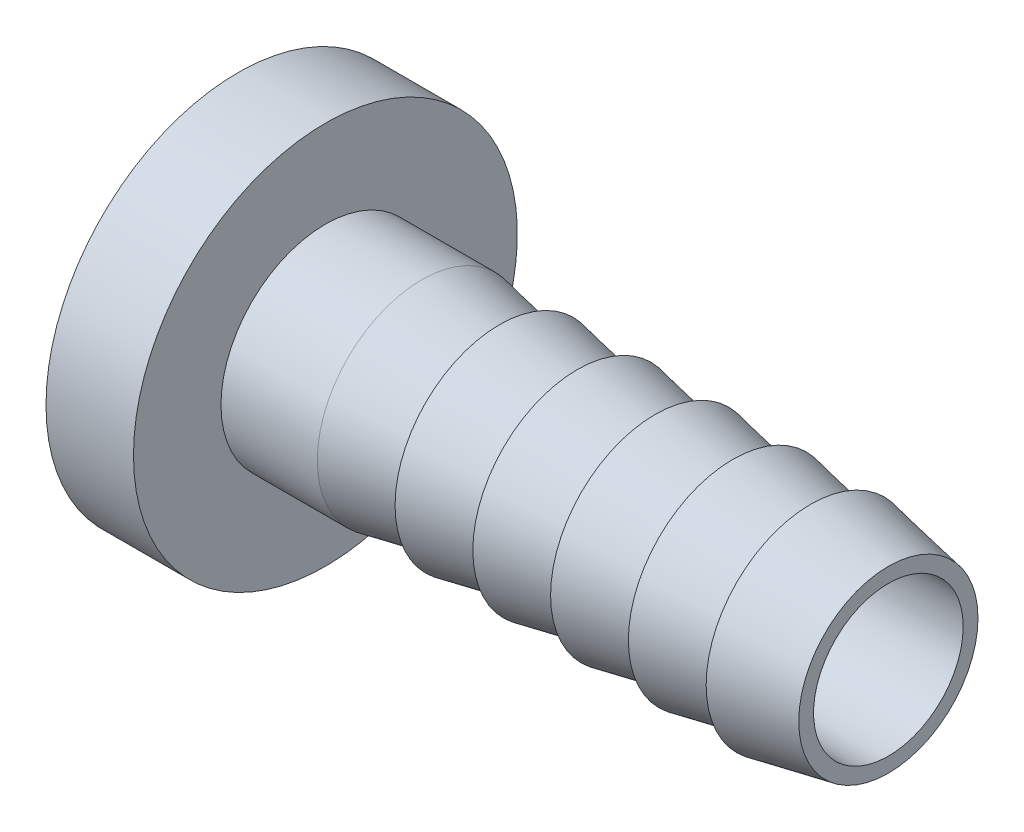
ISO-10303-21;
HEADER;
FILE_DESCRIPTION(('STEP AP214'),'2;1');
FILE_NAME('part.step','',(''),(''),'','','');
FILE_SCHEMA(('AUTOMOTIVE_DESIGN { 1 0 10303 214 1 1 1 1 }'));
ENDSEC;
DATA;
#1=APPLICATION_CONTEXT('core data for automotive mechanical design processes');
#2=APPLICATION_PROTOCOL_DEFINITION('international standard','automotive_design',2000,#1);
#3=PRODUCT_CONTEXT('',#1,'mechanical');
#4=PRODUCT('Part','Part','',(#3));
#5=PRODUCT_RELATED_PRODUCT_CATEGORY('part','',(#4));
#6=PRODUCT_DEFINITION_FORMATION('','',#4);
#7=PRODUCT_DEFINITION_CONTEXT('part definition',#1,'design');
#8=PRODUCT_DEFINITION('design','',#6,#7);
#9=PRODUCT_DEFINITION_SHAPE('','',#8);
#10=(LENGTH_UNIT() NAMED_UNIT(*) SI_UNIT(.MILLI.,.METRE.));
#11=(NAMED_UNIT(*) PLANE_ANGLE_UNIT() SI_UNIT($,.RADIAN.));
#12=(NAMED_UNIT(*) SI_UNIT($,.STERADIAN.) SOLID_ANGLE_UNIT());
#13=UNCERTAINTY_MEASURE_WITH_UNIT(LENGTH_MEASURE(1.E-05),#10,'distance_accuracy_value','');
#14=(GEOMETRIC_REPRESENTATION_CONTEXT(3) GLOBAL_UNCERTAINTY_ASSIGNED_CONTEXT((#13)) GLOBAL_UNIT_ASSIGNED_CONTEXT((#10,
#11,#12)) REPRESENTATION_CONTEXT('',''));
#15=CARTESIAN_POINT('',(0.,0.,0.));
#16=DIRECTION('',(0.,0.,1.));
#17=DIRECTION('',(1.,0.,0.));
#18=AXIS2_PLACEMENT_3D('',#15,#16,#17);
#19=CARTESIAN_POINT('',(10.16,0.,0.));
#20=DIRECTION('',(-1.,0.,0.));
#21=DIRECTION('',(0.,0.,1.));
#22=AXIS2_PLACEMENT_3D('',#19,#20,#21);
#23=CONICAL_SURFACE('',#22,3.5814,0.188221505304771);
#24=CARTESIAN_POINT('',(12.827,0.,0.));
#25=DIRECTION('',(-1.,0.,0.));
#26=DIRECTION('',(0.,0.,1.));
#27=AXIS2_PLACEMENT_3D('',#24,#25,#26);
#28=CIRCLE('',#27,3.0734);
#29=CARTESIAN_POINT('',(12.827,0.,3.0734));
#30=VERTEX_POINT('',#29);
#31=EDGE_CURVE('E84',#30,#30,#28,.T.);
#32=ORIENTED_EDGE('',*,*,#31,.T.);
#33=EDGE_LOOP('',(#32));
#34=FACE_BOUND('',#33,.T.);
#35=CARTESIAN_POINT('',(10.16,0.,0.));
#36=DIRECTION('',(-1.,0.,0.));
#37=DIRECTION('',(0.,0.,1.));
#38=AXIS2_PLACEMENT_3D('',#35,#36,#37);
#39=CIRCLE('',#38,3.5814);
#40=CARTESIAN_POINT('',(10.16,0.,3.5814));
#41=VERTEX_POINT('',#40);
#42=EDGE_CURVE('E96',#41,#41,#39,.T.);
#43=ORIENTED_EDGE('',*,*,#42,.F.);
#44=EDGE_LOOP('',(#43));
#45=FACE_BOUND('',#44,.T.);
#46=ADVANCED_FACE('F56',(#34,#45),#23,.T.);
#47=CARTESIAN_POINT('',(12.827,3.5814,0.));
#48=DIRECTION('',(-1.,0.,0.));
#49=DIRECTION('',(0.,0.,1.));
#50=AXIS2_PLACEMENT_3D('',#47,#48,#49);
#51=PLANE('',#50);
#52=CARTESIAN_POINT('',(12.827,0.,0.));
#53=DIRECTION('',(-1.,0.,0.));
#54=DIRECTION('',(0.,0.,1.));
#55=AXIS2_PLACEMENT_3D('',#52,#53,#54);
#56=CIRCLE('',#55,3.5814);
#57=CARTESIAN_POINT('',(12.827,0.,3.5814));
#58=VERTEX_POINT('',#57);
#59=EDGE_CURVE('E88',#58,#58,#56,.T.);
#60=ORIENTED_EDGE('',*,*,#59,.T.);
#61=EDGE_LOOP('',(#60));
#62=FACE_BOUND('',#61,.T.);
#63=ORIENTED_EDGE('',*,*,#31,.F.);
#64=EDGE_LOOP('',(#63));
#65=FACE_BOUND('',#64,.T.);
#66=ADVANCED_FACE('F151',(#62,#65),#51,.T.);
#67=CARTESIAN_POINT('',(20.828,3.5814,0.));
#68=DIRECTION('',(1.,0.,0.));
#69=DIRECTION('',(0.,0.,-1.));
#70=AXIS2_PLACEMENT_3D('',#67,#68,#69);
#71=PLANE('',#70);
#72=CARTESIAN_POINT('',(20.828,0.,0.));
#73=DIRECTION('',(1.,0.,0.));
#74=DIRECTION('',(0.,0.,-1.));
#75=AXIS2_PLACEMENT_3D('',#72,#73,#74);
#76=CIRCLE('',#75,2.5654);
#77=CARTESIAN_POINT('',(20.828,0.,-2.5654));
#78=VERTEX_POINT('',#77);
#79=EDGE_CURVE('E112',#78,#78,#76,.T.);
#80=ORIENTED_EDGE('',*,*,#79,.F.);
#81=EDGE_LOOP('',(#80));
#82=FACE_BOUND('',#81,.T.);
#83=CARTESIAN_POINT('',(20.828,0.,0.));
#84=DIRECTION('',(-1.,0.,0.));
#85=DIRECTION('',(0.,0.,1.));
#86=AXIS2_PLACEMENT_3D('',#83,#84,#85);
#87=CIRCLE('',#86,3.0734);
#88=CARTESIAN_POINT('',(20.828,0.,3.0734));
#89=VERTEX_POINT('',#88);
#90=EDGE_CURVE('E14',#89,#89,#87,.T.);
#91=ORIENTED_EDGE('',*,*,#90,.F.);
#92=EDGE_LOOP('',(#91));
#93=FACE_BOUND('',#92,.T.);
#94=ADVANCED_FACE('F58',(#82,#93),#71,.T.);
#95=CARTESIAN_POINT('',(18.161,0.,0.));
#96=DIRECTION('',(-1.,0.,0.));
#97=DIRECTION('',(0.,0.,1.));
#98=AXIS2_PLACEMENT_3D('',#95,#96,#97);
#99=CONICAL_SURFACE('',#98,3.5814,0.188221505304771);
#100=ORIENTED_EDGE('',*,*,#90,.T.);
#101=EDGE_LOOP('',(#100));
#102=FACE_BOUND('',#101,.T.);
#103=CARTESIAN_POINT('',(18.161,0.,0.));
#104=DIRECTION('',(-1.,0.,0.));
#105=DIRECTION('',(0.,0.,1.));
#106=AXIS2_PLACEMENT_3D('',#103,#104,#105);
#107=CIRCLE('',#106,3.5814);
#108=CARTESIAN_POINT('',(18.161,0.,3.5814));
#109=VERTEX_POINT('',#108);
#110=EDGE_CURVE('E69',#109,#109,#107,.T.);
#111=ORIENTED_EDGE('',*,*,#110,.F.);
#112=EDGE_LOOP('',(#111));
#113=FACE_BOUND('',#112,.T.);
#114=ADVANCED_FACE('F175',(#102,#113),#99,.T.);
#115=CARTESIAN_POINT('',(18.161,3.5814,0.));
#116=DIRECTION('',(-1.,0.,0.));
#117=DIRECTION('',(0.,0.,1.));
#118=AXIS2_PLACEMENT_3D('',#115,#116,#117);
#119=PLANE('',#118);
#120=ORIENTED_EDGE('',*,*,#110,.T.);
#121=EDGE_LOOP('',(#120));
#122=FACE_BOUND('',#121,.T.);
#123=CARTESIAN_POINT('',(18.161,0.,0.));
#124=DIRECTION('',(-1.,0.,0.));
#125=DIRECTION('',(0.,0.,1.));
#126=AXIS2_PLACEMENT_3D('',#123,#124,#125);
#127=CIRCLE('',#126,3.0734);
#128=CARTESIAN_POINT('',(18.161,0.,3.0734));
#129=VERTEX_POINT('',#128);
#130=EDGE_CURVE('E64',#129,#129,#127,.T.);
#131=ORIENTED_EDGE('',*,*,#130,.F.);
#132=EDGE_LOOP('',(#131));
#133=FACE_BOUND('',#132,.T.);
#134=ADVANCED_FACE('F172',(#122,#133),#119,.T.);
#135=CARTESIAN_POINT('',(15.494,0.,0.));
#136=DIRECTION('',(-1.,0.,0.));
#137=DIRECTION('',(0.,0.,1.));
#138=AXIS2_PLACEMENT_3D('',#135,#136,#137);
#139=CONICAL_SURFACE('',#138,3.5814,0.188221505304771);
#140=ORIENTED_EDGE('',*,*,#130,.T.);
#141=EDGE_LOOP('',(#140));
#142=FACE_BOUND('',#141,.T.);
#143=CARTESIAN_POINT('',(15.494,0.,0.));
#144=DIRECTION('',(-1.,0.,0.));
#145=DIRECTION('',(0.,0.,1.));
#146=AXIS2_PLACEMENT_3D('',#143,#144,#145);
#147=CIRCLE('',#146,3.5814);
#148=CARTESIAN_POINT('',(15.494,0.,3.5814));
#149=VERTEX_POINT('',#148);
#150=EDGE_CURVE('E80',#149,#149,#147,.T.);
#151=ORIENTED_EDGE('',*,*,#150,.F.);
#152=EDGE_LOOP('',(#151));
#153=FACE_BOUND('',#152,.T.);
#154=ADVANCED_FACE('F166',(#142,#153),#139,.T.);
#155=CARTESIAN_POINT('',(15.494,3.5814,0.));
#156=DIRECTION('',(-1.,0.,0.));
#157=DIRECTION('',(0.,0.,1.));
#158=AXIS2_PLACEMENT_3D('',#155,#156,#157);
#159=PLANE('',#158);
#160=ORIENTED_EDGE('',*,*,#150,.T.);
#161=EDGE_LOOP('',(#160));
#162=FACE_BOUND('',#161,.T.);
#163=CARTESIAN_POINT('',(15.494,0.,0.));
#164=DIRECTION('',(-1.,0.,0.));
#165=DIRECTION('',(0.,0.,1.));
#166=AXIS2_PLACEMENT_3D('',#163,#164,#165);
#167=CIRCLE('',#166,3.0734);
#168=CARTESIAN_POINT('',(15.494,0.,3.0734));
#169=VERTEX_POINT('',#168);
#170=EDGE_CURVE('E74',#169,#169,#167,.T.);
#171=ORIENTED_EDGE('',*,*,#170,.F.);
#172=EDGE_LOOP('',(#171));
#173=FACE_BOUND('',#172,.T.);
#174=ADVANCED_FACE('F162',(#162,#173),#159,.T.);
#175=CARTESIAN_POINT('',(12.827,0.,0.));
#176=DIRECTION('',(-1.,0.,0.));
#177=DIRECTION('',(0.,0.,1.));
#178=AXIS2_PLACEMENT_3D('',#175,#176,#177);
#179=CONICAL_SURFACE('',#178,3.5814,0.188221505304771);
#180=ORIENTED_EDGE('',*,*,#170,.T.);
#181=EDGE_LOOP('',(#180));
#182=FACE_BOUND('',#181,.T.);
#183=ORIENTED_EDGE('',*,*,#59,.F.);
#184=EDGE_LOOP('',(#183));
#185=FACE_BOUND('',#184,.T.);
#186=ADVANCED_FACE('F165',(#182,#185),#179,.T.);
#187=CARTESIAN_POINT('',(7.493,0.,0.));
#188=DIRECTION('',(-1.,0.,0.));
#189=DIRECTION('',(0.,0.,1.));
#190=AXIS2_PLACEMENT_3D('',#187,#188,#189);
#191=CONICAL_SURFACE('',#190,3.5814,0.188221505304771);
#192=CARTESIAN_POINT('',(10.16,0.,0.));
#193=DIRECTION('',(-1.,0.,0.));
#194=DIRECTION('',(0.,0.,1.));
#195=AXIS2_PLACEMENT_3D('',#192,#193,#194);
#196=CIRCLE('',#195,3.0734);
#197=CARTESIAN_POINT('',(10.16,0.,3.0734));
#198=VERTEX_POINT('',#197);
#199=EDGE_CURVE('E92',#198,#198,#196,.T.);
#200=ORIENTED_EDGE('',*,*,#199,.T.);
#201=EDGE_LOOP('',(#200));
#202=FACE_BOUND('',#201,.T.);
#203=CARTESIAN_POINT('',(7.493,0.,0.));
#204=DIRECTION('',(-1.,0.,0.));
#205=DIRECTION('',(0.,0.,1.));
#206=AXIS2_PLACEMENT_3D('',#203,#204,#205);
#207=CIRCLE('',#206,3.5814);
#208=CARTESIAN_POINT('',(7.493,0.,3.5814));
#209=VERTEX_POINT('',#208);
#210=EDGE_CURVE('E104',#209,#209,#207,.T.);
#211=ORIENTED_EDGE('',*,*,#210,.F.);
#212=EDGE_LOOP('',(#211));
#213=FACE_BOUND('',#212,.T.);
#214=ADVANCED_FACE('F170',(#202,#213),#191,.T.);
#215=CARTESIAN_POINT('',(10.16,3.5814,0.));
#216=DIRECTION('',(-1.,0.,0.));
#217=DIRECTION('',(0.,0.,1.));
#218=AXIS2_PLACEMENT_3D('',#215,#216,#217);
#219=PLANE('',#218);
#220=ORIENTED_EDGE('',*,*,#42,.T.);
#221=EDGE_LOOP('',(#220));
#222=FACE_BOUND('',#221,.T.);
#223=ORIENTED_EDGE('',*,*,#199,.F.);
#224=EDGE_LOOP('',(#223));
#225=FACE_BOUND('',#224,.T.);
#226=ADVANCED_FACE('F194',(#222,#225),#219,.T.);
#227=CARTESIAN_POINT('',(4.826,0.,0.));
#228=DIRECTION('',(-1.,0.,0.));
#229=DIRECTION('',(0.,0.,1.));
#230=AXIS2_PLACEMENT_3D('',#227,#228,#229);
#231=CONICAL_SURFACE('',#230,3.5814,0.188221505304771);
#232=CARTESIAN_POINT('',(7.493,0.,0.));
#233=DIRECTION('',(-1.,0.,0.));
#234=DIRECTION('',(0.,0.,1.));
#235=AXIS2_PLACEMENT_3D('',#232,#233,#234);
#236=CIRCLE('',#235,3.0734);
#237=CARTESIAN_POINT('',(7.493,0.,3.0734));
#238=VERTEX_POINT('',#237);
#239=EDGE_CURVE('E100',#238,#238,#236,.T.);
#240=ORIENTED_EDGE('',*,*,#239,.T.);
#241=EDGE_LOOP('',(#240));
#242=FACE_BOUND('',#241,.T.);
#243=CARTESIAN_POINT('',(4.826,0.,0.));
#244=DIRECTION('',(-1.,0.,0.));
#245=DIRECTION('',(0.,0.,1.));
#246=AXIS2_PLACEMENT_3D('',#243,#244,#245);
#247=CIRCLE('',#246,3.5814);
#248=CARTESIAN_POINT('',(4.826,0.,3.5814));
#249=VERTEX_POINT('',#248);
#250=EDGE_CURVE('E108',#249,#249,#247,.T.);
#251=ORIENTED_EDGE('',*,*,#250,.F.);
#252=EDGE_LOOP('',(#251));
#253=FACE_BOUND('',#252,.T.);
#254=ADVANCED_FACE('F186',(#242,#253),#231,.T.);
#255=CARTESIAN_POINT('',(7.493,3.5814,0.));
#256=DIRECTION('',(-1.,0.,0.));
#257=DIRECTION('',(0.,0.,1.));
#258=AXIS2_PLACEMENT_3D('',#255,#256,#257);
#259=PLANE('',#258);
#260=ORIENTED_EDGE('',*,*,#210,.T.);
#261=EDGE_LOOP('',(#260));
#262=FACE_BOUND('',#261,.T.);
#263=ORIENTED_EDGE('',*,*,#239,.F.);
#264=EDGE_LOOP('',(#263));
#265=FACE_BOUND('',#264,.T.);
#266=ADVANCED_FACE('F181',(#262,#265),#259,.T.);
#267=CARTESIAN_POINT('',(0.,0.,0.));
#268=DIRECTION('',(1.,0.,0.));
#269=DIRECTION('',(0.,0.,-1.));
#270=AXIS2_PLACEMENT_3D('',#267,#268,#269);
#271=CYLINDRICAL_SURFACE('',#270,3.5814);
#272=CARTESIAN_POINT('',(1.524,0.,0.));
#273=DIRECTION('',(1.,0.,0.));
#274=DIRECTION('',(0.,0.,-1.));
#275=AXIS2_PLACEMENT_3D('',#272,#273,#274);
#276=CIRCLE('',#275,3.5814);
#277=CARTESIAN_POINT('',(1.524,0.,-3.5814));
#278=VERTEX_POINT('',#277);
#279=EDGE_CURVE('E116',#278,#278,#276,.F.);
#280=ORIENTED_EDGE('',*,*,#279,.F.);
#281=EDGE_LOOP('',(#280));
#282=FACE_BOUND('',#281,.T.);
#283=ORIENTED_EDGE('',*,*,#250,.T.);
#284=EDGE_LOOP('',(#283));
#285=FACE_BOUND('',#284,.T.);
#286=ADVANCED_FACE('F147',(#282,#285),#271,.T.);
#287=CARTESIAN_POINT('',(-9.79604694582388,0.,0.));
#288=DIRECTION('',(1.,0.,0.));
#289=DIRECTION('',(0.,0.,-1.));
#290=AXIS2_PLACEMENT_3D('',#287,#288,#289);
#291=CYLINDRICAL_SURFACE('',#290,2.5654);
#292=ORIENTED_EDGE('',*,*,#79,.T.);
#293=EDGE_LOOP('',(#292));
#294=FACE_BOUND('',#293,.T.);
#295=CARTESIAN_POINT('',(-1.476,0.,0.));
#296=DIRECTION('',(-1.,0.,0.));
#297=DIRECTION('',(0.,0.,1.));
#298=AXIS2_PLACEMENT_3D('',#295,#296,#297);
#299=CIRCLE('',#298,2.5654);
#300=CARTESIAN_POINT('',(-1.476,0.,2.5654));
#301=VERTEX_POINT('',#300);
#302=EDGE_CURVE('E125',#301,#301,#299,.T.);
#303=ORIENTED_EDGE('',*,*,#302,.T.);
#304=EDGE_LOOP('',(#303));
#305=FACE_BOUND('',#304,.T.);
#306=ADVANCED_FACE('F133',(#294,#305),#291,.F.);
#307=CARTESIAN_POINT('',(-1.476,0.,0.));
#308=DIRECTION('',(-1.,0.,0.));
#309=DIRECTION('',(0.,0.,1.));
#310=AXIS2_PLACEMENT_3D('',#307,#308,#309);
#311=PLANE('',#310);
#312=CARTESIAN_POINT('',(-1.476,0.,0.));
#313=DIRECTION('',(-1.,0.,0.));
#314=DIRECTION('',(0.,0.,1.));
#315=AXIS2_PLACEMENT_3D('',#312,#313,#314);
#316=CIRCLE('',#315,6.5814);
#317=CARTESIAN_POINT('',(-1.476,0.,6.5814));
#318=VERTEX_POINT('',#317);
#319=EDGE_CURVE('E120',#318,#318,#316,.T.);
#320=ORIENTED_EDGE('',*,*,#319,.T.);
#321=EDGE_LOOP('',(#320));
#322=FACE_BOUND('',#321,.T.);
#323=ORIENTED_EDGE('',*,*,#302,.F.);
#324=EDGE_LOOP('',(#323));
#325=FACE_BOUND('',#324,.T.);
#326=ADVANCED_FACE('F135',(#322,#325),#311,.T.);
#327=CARTESIAN_POINT('',(1.524,0.,0.));
#328=DIRECTION('',(-1.,0.,0.));
#329=DIRECTION('',(0.,0.,1.));
#330=AXIS2_PLACEMENT_3D('',#327,#328,#329);
#331=PLANE('',#330);
#332=ORIENTED_EDGE('',*,*,#279,.T.);
#333=EDGE_LOOP('',(#332));
#334=FACE_BOUND('',#333,.T.);
#335=CARTESIAN_POINT('',(1.524,0.,0.));
#336=DIRECTION('',(-1.,0.,0.));
#337=DIRECTION('',(0.,0.,1.));
#338=AXIS2_PLACEMENT_3D('',#335,#336,#337);
#339=CIRCLE('',#338,6.5814);
#340=CARTESIAN_POINT('',(1.524,0.,6.5814));
#341=VERTEX_POINT('',#340);
#342=EDGE_CURVE('E121',#341,#341,#339,.T.);
#343=ORIENTED_EDGE('',*,*,#342,.F.);
#344=EDGE_LOOP('',(#343));
#345=FACE_BOUND('',#344,.T.);
#346=ADVANCED_FACE('F137',(#334,#345),#331,.F.);
#347=CARTESIAN_POINT('',(-1.476,0.,0.));
#348=DIRECTION('',(1.,0.,0.));
#349=DIRECTION('',(0.,0.,-1.));
#350=AXIS2_PLACEMENT_3D('',#347,#348,#349);
#351=CYLINDRICAL_SURFACE('',#350,6.5814);
#352=ORIENTED_EDGE('',*,*,#319,.F.);
#353=EDGE_LOOP('',(#352));
#354=FACE_BOUND('',#353,.T.);
#355=ORIENTED_EDGE('',*,*,#342,.T.);
#356=EDGE_LOOP('',(#355));
#357=FACE_BOUND('',#356,.T.);
#358=ADVANCED_FACE('F144',(#354,#357),#351,.T.);
#359=CLOSED_SHELL('',(#46,#66,#94,#114,#134,#154,#174,#186,#214,#226,#254,#266,#286,#306,#326,
#346,#358));
#360=MANIFOLD_SOLID_BREP('B2',#359);
#361=ADVANCED_BREP_SHAPE_REPRESENTATION('',(#18,#360),#14);
#362=SHAPE_DEFINITION_REPRESENTATION(#9,#361);
ENDSEC;
END-ISO-10303-21;
